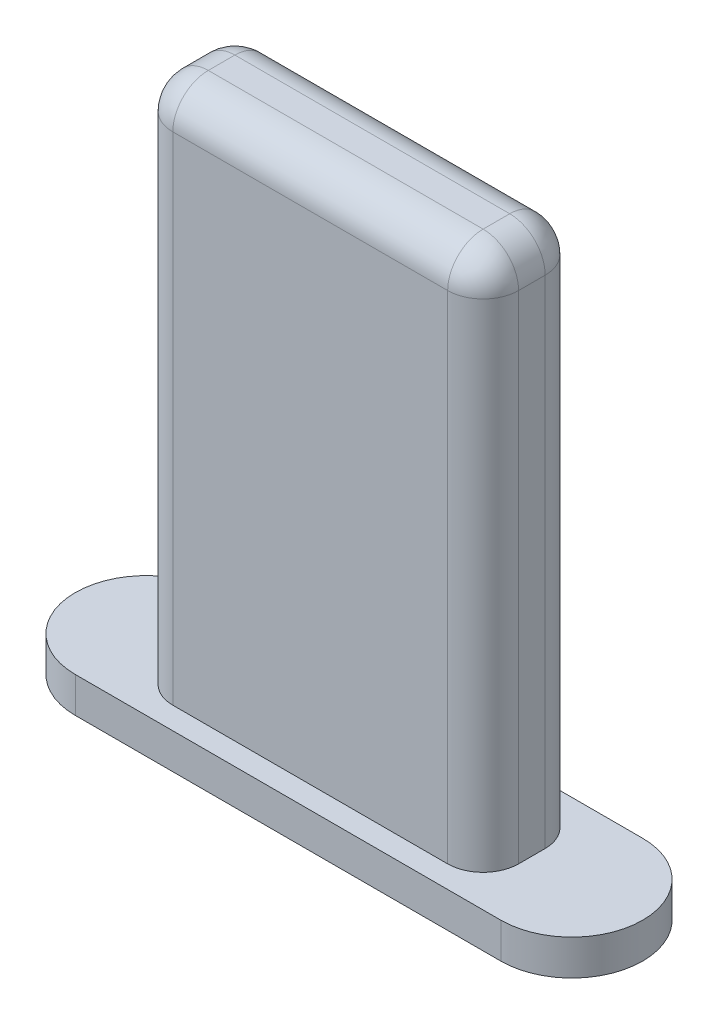
ISO-10303-21;
HEADER;
FILE_DESCRIPTION(('STEP AP214'),'2;1');
FILE_NAME('part.step','',(''),(''),'','','');
FILE_SCHEMA(('AUTOMOTIVE_DESIGN { 1 0 10303 214 1 1 1 1 }'));
ENDSEC;
DATA;
#1=APPLICATION_CONTEXT('core data for automotive mechanical design processes');
#2=APPLICATION_PROTOCOL_DEFINITION('international standard','automotive_design',2000,#1);
#3=PRODUCT_CONTEXT('',#1,'mechanical');
#4=PRODUCT('Part','Part','',(#3));
#5=PRODUCT_RELATED_PRODUCT_CATEGORY('part','',(#4));
#6=PRODUCT_DEFINITION_FORMATION('','',#4);
#7=PRODUCT_DEFINITION_CONTEXT('part definition',#1,'design');
#8=PRODUCT_DEFINITION('design','',#6,#7);
#9=PRODUCT_DEFINITION_SHAPE('','',#8);
#10=(LENGTH_UNIT() NAMED_UNIT(*) SI_UNIT(.MILLI.,.METRE.));
#11=(NAMED_UNIT(*) PLANE_ANGLE_UNIT() SI_UNIT($,.RADIAN.));
#12=(NAMED_UNIT(*) SI_UNIT($,.STERADIAN.) SOLID_ANGLE_UNIT());
#13=UNCERTAINTY_MEASURE_WITH_UNIT(LENGTH_MEASURE(1.E-05),#10,'distance_accuracy_value','');
#14=(GEOMETRIC_REPRESENTATION_CONTEXT(3) GLOBAL_UNCERTAINTY_ASSIGNED_CONTEXT((#13)) GLOBAL_UNIT_ASSIGNED_CONTEXT((#10,
#11,#12)) REPRESENTATION_CONTEXT('',''));
#15=CARTESIAN_POINT('',(0.,0.,0.));
#16=DIRECTION('',(0.,0.,1.));
#17=DIRECTION('',(1.,0.,0.));
#18=AXIS2_PLACEMENT_3D('',#15,#16,#17);
#19=CARTESIAN_POINT('',(6.,1.,0.));
#20=DIRECTION('',(0.,-1.,0.));
#21=DIRECTION('',(0.,0.,-1.));
#22=AXIS2_PLACEMENT_3D('',#19,#20,#21);
#23=CYLINDRICAL_SURFACE('',#22,2.);
#24=CARTESIAN_POINT('',(6.,0.,0.));
#25=DIRECTION('',(0.,1.,0.));
#26=DIRECTION('',(0.,0.,1.));
#27=AXIS2_PLACEMENT_3D('',#24,#25,#26);
#28=CIRCLE('',#27,2.);
#29=CARTESIAN_POINT('',(6.,0.,2.));
#30=VERTEX_POINT('',#29);
#31=CARTESIAN_POINT('',(6.,0.,-2.));
#32=VERTEX_POINT('',#31);
#33=EDGE_CURVE('E162',#30,#32,#28,.T.);
#34=ORIENTED_EDGE('',*,*,#33,.T.);
#35=DIRECTION('',(0.,-1.,0.));
#36=VECTOR('',#35,1.);
#37=CARTESIAN_POINT('',(6.,1.,-2.));
#38=LINE('',#37,#36);
#39=CARTESIAN_POINT('',(6.,1.,-2.));
#40=VERTEX_POINT('',#39);
#41=EDGE_CURVE('E143',#40,#32,#38,.T.);
#42=ORIENTED_EDGE('',*,*,#41,.F.);
#43=CARTESIAN_POINT('',(6.,1.,0.));
#44=DIRECTION('',(0.,1.,0.));
#45=DIRECTION('',(0.,0.,1.));
#46=AXIS2_PLACEMENT_3D('',#43,#44,#45);
#47=CIRCLE('',#46,2.);
#48=CARTESIAN_POINT('',(6.,1.,2.));
#49=VERTEX_POINT('',#48);
#50=EDGE_CURVE('E150',#49,#40,#47,.T.);
#51=ORIENTED_EDGE('',*,*,#50,.F.);
#52=DIRECTION('',(0.,-1.,0.));
#53=VECTOR('',#52,1.);
#54=CARTESIAN_POINT('',(6.,1.,2.));
#55=LINE('',#54,#53);
#56=EDGE_CURVE('E305',#49,#30,#55,.T.);
#57=ORIENTED_EDGE('',*,*,#56,.T.);
#58=EDGE_LOOP('',(#34,#42,#51,#57));
#59=FACE_BOUND('',#58,.T.);
#60=ADVANCED_FACE('F36',(#59),#23,.T.);
#61=CARTESIAN_POINT('',(6.,1.,-2.));
#62=DIRECTION('',(0.,0.,1.));
#63=DIRECTION('',(1.,0.,0.));
#64=AXIS2_PLACEMENT_3D('',#61,#62,#63);
#65=PLANE('',#64);
#66=DIRECTION('',(-1.,0.,0.));
#67=VECTOR('',#66,1.);
#68=CARTESIAN_POINT('',(6.,0.,-2.));
#69=LINE('',#68,#67);
#70=CARTESIAN_POINT('',(-6.,0.,-2.));
#71=VERTEX_POINT('',#70);
#72=EDGE_CURVE('E307',#32,#71,#69,.T.);
#73=ORIENTED_EDGE('',*,*,#72,.T.);
#74=DIRECTION('',(0.,-1.,0.));
#75=VECTOR('',#74,1.);
#76=CARTESIAN_POINT('',(-6.,1.,-2.));
#77=LINE('',#76,#75);
#78=CARTESIAN_POINT('',(-6.,1.,-2.));
#79=VERTEX_POINT('',#78);
#80=EDGE_CURVE('E146',#79,#71,#77,.T.);
#81=ORIENTED_EDGE('',*,*,#80,.F.);
#82=DIRECTION('',(-1.,0.,0.));
#83=VECTOR('',#82,1.);
#84=CARTESIAN_POINT('',(6.,1.,-2.));
#85=LINE('',#84,#83);
#86=EDGE_CURVE('E139',#40,#79,#85,.T.);
#87=ORIENTED_EDGE('',*,*,#86,.F.);
#88=ORIENTED_EDGE('',*,*,#41,.T.);
#89=EDGE_LOOP('',(#73,#81,#87,#88));
#90=FACE_BOUND('',#89,.T.);
#91=ADVANCED_FACE('F141',(#90),#65,.F.);
#92=CARTESIAN_POINT('',(-6.,1.,0.));
#93=DIRECTION('',(0.,-1.,0.));
#94=DIRECTION('',(0.,0.,-1.));
#95=AXIS2_PLACEMENT_3D('',#92,#93,#94);
#96=CYLINDRICAL_SURFACE('',#95,2.);
#97=CARTESIAN_POINT('',(-6.,0.,0.));
#98=DIRECTION('',(0.,1.,0.));
#99=DIRECTION('',(0.,0.,1.));
#100=AXIS2_PLACEMENT_3D('',#97,#98,#99);
#101=CIRCLE('',#100,2.);
#102=CARTESIAN_POINT('',(-6.,0.,2.));
#103=VERTEX_POINT('',#102);
#104=EDGE_CURVE('E309',#71,#103,#101,.T.);
#105=ORIENTED_EDGE('',*,*,#104,.T.);
#106=DIRECTION('',(0.,-1.,0.));
#107=VECTOR('',#106,1.);
#108=CARTESIAN_POINT('',(-6.,1.,2.));
#109=LINE('',#108,#107);
#110=CARTESIAN_POINT('',(-6.,1.,2.));
#111=VERTEX_POINT('',#110);
#112=EDGE_CURVE('E168',#111,#103,#109,.T.);
#113=ORIENTED_EDGE('',*,*,#112,.F.);
#114=CARTESIAN_POINT('',(-6.,1.,0.));
#115=DIRECTION('',(0.,1.,0.));
#116=DIRECTION('',(0.,0.,1.));
#117=AXIS2_PLACEMENT_3D('',#114,#115,#116);
#118=CIRCLE('',#117,2.);
#119=EDGE_CURVE('E149',#79,#111,#118,.T.);
#120=ORIENTED_EDGE('',*,*,#119,.F.);
#121=ORIENTED_EDGE('',*,*,#80,.T.);
#122=EDGE_LOOP('',(#105,#113,#120,#121));
#123=FACE_BOUND('',#122,.T.);
#124=ADVANCED_FACE('F321',(#123),#96,.T.);
#125=CARTESIAN_POINT('',(6.,1.,2.));
#126=DIRECTION('',(0.,0.,-1.));
#127=DIRECTION('',(-1.,0.,0.));
#128=AXIS2_PLACEMENT_3D('',#125,#126,#127);
#129=PLANE('',#128);
#130=DIRECTION('',(1.,0.,0.));
#131=VECTOR('',#130,1.);
#132=CARTESIAN_POINT('',(6.,0.,2.));
#133=LINE('',#132,#131);
#134=EDGE_CURVE('E159',#103,#30,#133,.T.);
#135=ORIENTED_EDGE('',*,*,#134,.T.);
#136=ORIENTED_EDGE('',*,*,#56,.F.);
#137=DIRECTION('',(1.,0.,0.));
#138=VECTOR('',#137,1.);
#139=CARTESIAN_POINT('',(6.,1.,2.));
#140=LINE('',#139,#138);
#141=EDGE_CURVE('E155',#111,#49,#140,.T.);
#142=ORIENTED_EDGE('',*,*,#141,.F.);
#143=ORIENTED_EDGE('',*,*,#112,.T.);
#144=EDGE_LOOP('',(#135,#136,#142,#143));
#145=FACE_BOUND('',#144,.T.);
#146=ADVANCED_FACE('F316',(#145),#129,.F.);
#147=CARTESIAN_POINT('',(6.,1.,0.));
#148=DIRECTION('',(0.,1.,0.));
#149=DIRECTION('',(0.,0.,1.));
#150=AXIS2_PLACEMENT_3D('',#147,#148,#149);
#151=PLANE('',#150);
#152=DIRECTION('',(0.,0.,1.));
#153=VECTOR('',#152,1.);
#154=CARTESIAN_POINT('',(-4.875,1.,1.375));
#155=LINE('',#154,#153);
#156=CARTESIAN_POINT('',(-4.875,1.,-0.374999999999999));
#157=VERTEX_POINT('',#156);
#158=CARTESIAN_POINT('',(-4.875,1.,0.375000000000001));
#159=VERTEX_POINT('',#158);
#160=EDGE_CURVE('E233',#157,#159,#155,.T.);
#161=ORIENTED_EDGE('',*,*,#160,.F.);
#162=CARTESIAN_POINT('',(-3.875,1.,-0.374999999999999));
#163=DIRECTION('',(0.,1.,0.));
#164=DIRECTION('',(0.,0.,1.));
#165=AXIS2_PLACEMENT_3D('',#162,#163,#164);
#166=CIRCLE('',#165,1.);
#167=CARTESIAN_POINT('',(-3.875,1.,-1.375));
#168=VERTEX_POINT('',#167);
#169=EDGE_CURVE('E228',#157,#168,#166,.F.);
#170=ORIENTED_EDGE('',*,*,#169,.T.);
#171=DIRECTION('',(-1.,0.,0.));
#172=VECTOR('',#171,1.);
#173=CARTESIAN_POINT('',(4.875,1.,-1.375));
#174=LINE('',#173,#172);
#175=CARTESIAN_POINT('',(3.875,1.,-1.375));
#176=VERTEX_POINT('',#175);
#177=EDGE_CURVE('E300',#176,#168,#174,.T.);
#178=ORIENTED_EDGE('',*,*,#177,.F.);
#179=CARTESIAN_POINT('',(3.875,1.,-0.375));
#180=DIRECTION('',(0.,1.,0.));
#181=DIRECTION('',(0.,0.,1.));
#182=AXIS2_PLACEMENT_3D('',#179,#180,#181);
#183=CIRCLE('',#182,1.);
#184=CARTESIAN_POINT('',(4.875,1.,-0.375));
#185=VERTEX_POINT('',#184);
#186=EDGE_CURVE('E226',#176,#185,#183,.F.);
#187=ORIENTED_EDGE('',*,*,#186,.T.);
#188=DIRECTION('',(0.,0.,-1.));
#189=VECTOR('',#188,1.);
#190=CARTESIAN_POINT('',(4.875,1.,1.375));
#191=LINE('',#190,#189);
#192=CARTESIAN_POINT('',(4.875,1.,0.375));
#193=VERTEX_POINT('',#192);
#194=EDGE_CURVE('E258',#193,#185,#191,.T.);
#195=ORIENTED_EDGE('',*,*,#194,.F.);
#196=CARTESIAN_POINT('',(3.875,1.,0.375));
#197=DIRECTION('',(0.,1.,0.));
#198=DIRECTION('',(0.,0.,1.));
#199=AXIS2_PLACEMENT_3D('',#196,#197,#198);
#200=CIRCLE('',#199,1.);
#201=CARTESIAN_POINT('',(3.875,1.,1.375));
#202=VERTEX_POINT('',#201);
#203=EDGE_CURVE('E11',#193,#202,#200,.F.);
#204=ORIENTED_EDGE('',*,*,#203,.T.);
#205=DIRECTION('',(1.,0.,0.));
#206=VECTOR('',#205,1.);
#207=CARTESIAN_POINT('',(4.875,1.,1.375));
#208=LINE('',#207,#206);
#209=CARTESIAN_POINT('',(-3.875,1.,1.375));
#210=VERTEX_POINT('',#209);
#211=EDGE_CURVE('E292',#210,#202,#208,.T.);
#212=ORIENTED_EDGE('',*,*,#211,.F.);
#213=CARTESIAN_POINT('',(-3.875,1.,0.375000000000001));
#214=DIRECTION('',(0.,1.,0.));
#215=DIRECTION('',(0.,0.,1.));
#216=AXIS2_PLACEMENT_3D('',#213,#214,#215);
#217=CIRCLE('',#216,1.);
#218=EDGE_CURVE('E45',#210,#159,#217,.F.);
#219=ORIENTED_EDGE('',*,*,#218,.T.);
#220=EDGE_LOOP('',(#161,#170,#178,#187,#195,#204,#212,#219));
#221=FACE_BOUND('',#220,.T.);
#222=ORIENTED_EDGE('',*,*,#50,.T.);
#223=ORIENTED_EDGE('',*,*,#86,.T.);
#224=ORIENTED_EDGE('',*,*,#119,.T.);
#225=ORIENTED_EDGE('',*,*,#141,.T.);
#226=EDGE_LOOP('',(#222,#223,#224,#225));
#227=FACE_BOUND('',#226,.T.);
#228=ADVANCED_FACE('F153',(#221,#227),#151,.T.);
#229=CARTESIAN_POINT('',(6.,0.,0.));
#230=DIRECTION('',(0.,1.,0.));
#231=DIRECTION('',(0.,0.,1.));
#232=AXIS2_PLACEMENT_3D('',#229,#230,#231);
#233=PLANE('',#232);
#234=ORIENTED_EDGE('',*,*,#33,.F.);
#235=ORIENTED_EDGE('',*,*,#134,.F.);
#236=ORIENTED_EDGE('',*,*,#104,.F.);
#237=ORIENTED_EDGE('',*,*,#72,.F.);
#238=EDGE_LOOP('',(#234,#235,#236,#237));
#239=FACE_BOUND('',#238,.T.);
#240=ADVANCED_FACE('F320',(#239),#233,.F.);
#241=CARTESIAN_POINT('',(-4.875,16.,1.375));
#242=DIRECTION('',(1.,0.,0.));
#243=DIRECTION('',(0.,0.,-1.));
#244=AXIS2_PLACEMENT_3D('',#241,#242,#243);
#245=PLANE('',#244);
#246=DIRECTION('',(0.,0.,1.));
#247=VECTOR('',#246,1.);
#248=CARTESIAN_POINT('',(-4.875,15.,-1.375));
#249=LINE('',#248,#247);
#250=CARTESIAN_POINT('',(-4.875,15.,0.375000000000001));
#251=VERTEX_POINT('',#250);
#252=CARTESIAN_POINT('',(-4.875,15.,-0.374999999999999));
#253=VERTEX_POINT('',#252);
#254=EDGE_CURVE('E188',#251,#253,#249,.F.);
#255=ORIENTED_EDGE('',*,*,#254,.T.);
#256=DIRECTION('',(0.,-1.,0.));
#257=VECTOR('',#256,1.);
#258=CARTESIAN_POINT('',(-4.875,16.,-0.374999999999999));
#259=LINE('',#258,#257);
#260=EDGE_CURVE('E221',#253,#157,#259,.T.);
#261=ORIENTED_EDGE('',*,*,#260,.T.);
#262=ORIENTED_EDGE('',*,*,#160,.T.);
#263=DIRECTION('',(0.,-1.,0.));
#264=VECTOR('',#263,1.);
#265=CARTESIAN_POINT('',(-4.875,16.,0.375000000000001));
#266=LINE('',#265,#264);
#267=EDGE_CURVE('E219',#159,#251,#266,.F.);
#268=ORIENTED_EDGE('',*,*,#267,.T.);
#269=EDGE_LOOP('',(#255,#261,#262,#268));
#270=FACE_BOUND('',#269,.T.);
#271=ADVANCED_FACE('F294',(#270),#245,.F.);
#272=CARTESIAN_POINT('',(4.875,16.,1.375));
#273=DIRECTION('',(0.,0.,-1.));
#274=DIRECTION('',(-1.,0.,0.));
#275=AXIS2_PLACEMENT_3D('',#272,#273,#274);
#276=PLANE('',#275);
#277=DIRECTION('',(1.,0.,0.));
#278=VECTOR('',#277,1.);
#279=CARTESIAN_POINT('',(-4.875,15.,1.375));
#280=LINE('',#279,#278);
#281=CARTESIAN_POINT('',(3.875,15.,1.375));
#282=VERTEX_POINT('',#281);
#283=CARTESIAN_POINT('',(-3.875,15.,1.375));
#284=VERTEX_POINT('',#283);
#285=EDGE_CURVE('E186',#282,#284,#280,.F.);
#286=ORIENTED_EDGE('',*,*,#285,.T.);
#287=DIRECTION('',(0.,-1.,0.));
#288=VECTOR('',#287,1.);
#289=CARTESIAN_POINT('',(-3.875,16.,1.375));
#290=LINE('',#289,#288);
#291=EDGE_CURVE('E58',#284,#210,#290,.T.);
#292=ORIENTED_EDGE('',*,*,#291,.T.);
#293=ORIENTED_EDGE('',*,*,#211,.T.);
#294=DIRECTION('',(0.,-1.,0.));
#295=VECTOR('',#294,1.);
#296=CARTESIAN_POINT('',(3.875,16.,1.375));
#297=LINE('',#296,#295);
#298=EDGE_CURVE('E223',#202,#282,#297,.F.);
#299=ORIENTED_EDGE('',*,*,#298,.T.);
#300=EDGE_LOOP('',(#286,#292,#293,#299));
#301=FACE_BOUND('',#300,.T.);
#302=ADVANCED_FACE('F284',(#301),#276,.F.);
#303=CARTESIAN_POINT('',(4.875,16.,1.375));
#304=DIRECTION('',(-1.,0.,0.));
#305=DIRECTION('',(0.,0.,1.));
#306=AXIS2_PLACEMENT_3D('',#303,#304,#305);
#307=PLANE('',#306);
#308=ORIENTED_EDGE('',*,*,#194,.T.);
#309=DIRECTION('',(0.,-1.,0.));
#310=VECTOR('',#309,1.);
#311=CARTESIAN_POINT('',(4.875,16.,-0.375));
#312=LINE('',#311,#310);
#313=CARTESIAN_POINT('',(4.875,15.,-0.375));
#314=VERTEX_POINT('',#313);
#315=EDGE_CURVE('E217',#185,#314,#312,.F.);
#316=ORIENTED_EDGE('',*,*,#315,.T.);
#317=DIRECTION('',(0.,0.,-1.));
#318=VECTOR('',#317,1.);
#319=CARTESIAN_POINT('',(4.875,15.,1.375));
#320=LINE('',#319,#318);
#321=CARTESIAN_POINT('',(4.875,15.,0.375));
#322=VERTEX_POINT('',#321);
#323=EDGE_CURVE('E183',#314,#322,#320,.F.);
#324=ORIENTED_EDGE('',*,*,#323,.T.);
#325=DIRECTION('',(0.,-1.,0.));
#326=VECTOR('',#325,1.);
#327=CARTESIAN_POINT('',(4.875,16.,0.375));
#328=LINE('',#327,#326);
#329=EDGE_CURVE('E215',#322,#193,#328,.T.);
#330=ORIENTED_EDGE('',*,*,#329,.T.);
#331=EDGE_LOOP('',(#308,#316,#324,#330));
#332=FACE_BOUND('',#331,.T.);
#333=ADVANCED_FACE('F256',(#332),#307,.F.);
#334=CARTESIAN_POINT('',(4.875,16.,-1.375));
#335=DIRECTION('',(0.,0.,1.));
#336=DIRECTION('',(1.,0.,0.));
#337=AXIS2_PLACEMENT_3D('',#334,#335,#336);
#338=PLANE('',#337);
#339=DIRECTION('',(-1.,0.,0.));
#340=VECTOR('',#339,1.);
#341=CARTESIAN_POINT('',(4.875,15.,-1.375));
#342=LINE('',#341,#340);
#343=CARTESIAN_POINT('',(-3.875,15.,-1.375));
#344=VERTEX_POINT('',#343);
#345=CARTESIAN_POINT('',(3.875,15.,-1.375));
#346=VERTEX_POINT('',#345);
#347=EDGE_CURVE('E180',#344,#346,#342,.F.);
#348=ORIENTED_EDGE('',*,*,#347,.T.);
#349=DIRECTION('',(0.,-1.,0.));
#350=VECTOR('',#349,1.);
#351=CARTESIAN_POINT('',(3.875,16.,-1.375));
#352=LINE('',#351,#350);
#353=EDGE_CURVE('E213',#346,#176,#352,.T.);
#354=ORIENTED_EDGE('',*,*,#353,.T.);
#355=ORIENTED_EDGE('',*,*,#177,.T.);
#356=DIRECTION('',(0.,-1.,0.));
#357=VECTOR('',#356,1.);
#358=CARTESIAN_POINT('',(-3.875,16.,-1.375));
#359=LINE('',#358,#357);
#360=EDGE_CURVE('E211',#168,#344,#359,.F.);
#361=ORIENTED_EDGE('',*,*,#360,.T.);
#362=EDGE_LOOP('',(#348,#354,#355,#361));
#363=FACE_BOUND('',#362,.T.);
#364=ADVANCED_FACE('F419',(#363),#338,.F.);
#365=CARTESIAN_POINT('',(0.,16.,0.));
#366=DIRECTION('',(0.,1.,0.));
#367=DIRECTION('',(0.,0.,1.));
#368=AXIS2_PLACEMENT_3D('',#365,#366,#367);
#369=PLANE('',#368);
#370=DIRECTION('',(0.,0.,-1.));
#371=VECTOR('',#370,1.);
#372=CARTESIAN_POINT('',(3.875,16.,-1.375));
#373=LINE('',#372,#371);
#374=CARTESIAN_POINT('',(3.875,16.,0.375));
#375=VERTEX_POINT('',#374);
#376=CARTESIAN_POINT('',(3.875,16.,-0.375));
#377=VERTEX_POINT('',#376);
#378=EDGE_CURVE('E174',#375,#377,#373,.T.);
#379=ORIENTED_EDGE('',*,*,#378,.T.);
#380=DIRECTION('',(-1.,0.,0.));
#381=VECTOR('',#380,1.);
#382=CARTESIAN_POINT('',(-4.875,16.,-0.374999999999999));
#383=LINE('',#382,#381);
#384=CARTESIAN_POINT('',(-3.875,16.,-0.374999999999999));
#385=VERTEX_POINT('',#384);
#386=EDGE_CURVE('E177',#377,#385,#383,.T.);
#387=ORIENTED_EDGE('',*,*,#386,.T.);
#388=DIRECTION('',(0.,0.,1.));
#389=VECTOR('',#388,1.);
#390=CARTESIAN_POINT('',(-3.875,16.,1.375));
#391=LINE('',#390,#389);
#392=CARTESIAN_POINT('',(-3.875,16.,0.375000000000001));
#393=VERTEX_POINT('',#392);
#394=EDGE_CURVE('E163',#385,#393,#391,.T.);
#395=ORIENTED_EDGE('',*,*,#394,.T.);
#396=DIRECTION('',(1.,0.,0.));
#397=VECTOR('',#396,1.);
#398=CARTESIAN_POINT('',(4.875,16.,0.374999999999999));
#399=LINE('',#398,#397);
#400=EDGE_CURVE('E166',#393,#375,#399,.T.);
#401=ORIENTED_EDGE('',*,*,#400,.T.);
#402=EDGE_LOOP('',(#379,#387,#395,#401));
#403=FACE_BOUND('',#402,.T.);
#404=ADVANCED_FACE('F269',(#403),#369,.T.);
#405=CARTESIAN_POINT('',(0.,15.,0.375));
#406=DIRECTION('',(-1.,0.,0.));
#407=DIRECTION('',(0.,0.,1.));
#408=AXIS2_PLACEMENT_3D('',#405,#406,#407);
#409=CYLINDRICAL_SURFACE('',#408,1.);
#410=ORIENTED_EDGE('',*,*,#400,.F.);
#411=CARTESIAN_POINT('',(-3.875,15.,0.375000000000001));
#412=DIRECTION('',(-1.,0.,0.));
#413=DIRECTION('',(0.,0.,1.));
#414=AXIS2_PLACEMENT_3D('',#411,#412,#413);
#415=CIRCLE('',#414,1.);
#416=EDGE_CURVE('E209',#393,#284,#415,.F.);
#417=ORIENTED_EDGE('',*,*,#416,.T.);
#418=ORIENTED_EDGE('',*,*,#285,.F.);
#419=CARTESIAN_POINT('',(3.875,15.,0.375));
#420=DIRECTION('',(-1.,0.,0.));
#421=DIRECTION('',(0.,0.,1.));
#422=AXIS2_PLACEMENT_3D('',#419,#420,#421);
#423=CIRCLE('',#422,1.);
#424=EDGE_CURVE('E207',#282,#375,#423,.T.);
#425=ORIENTED_EDGE('',*,*,#424,.T.);
#426=EDGE_LOOP('',(#410,#417,#418,#425));
#427=FACE_BOUND('',#426,.T.);
#428=ADVANCED_FACE('F282',(#427),#409,.T.);
#429=CARTESIAN_POINT('',(3.875,15.,0.));
#430=DIRECTION('',(0.,0.,1.));
#431=DIRECTION('',(1.,0.,0.));
#432=AXIS2_PLACEMENT_3D('',#429,#430,#431);
#433=CYLINDRICAL_SURFACE('',#432,1.);
#434=ORIENTED_EDGE('',*,*,#323,.F.);
#435=CARTESIAN_POINT('',(3.875,15.,-0.375));
#436=DIRECTION('',(0.,0.,1.));
#437=DIRECTION('',(1.,0.,0.));
#438=AXIS2_PLACEMENT_3D('',#435,#436,#437);
#439=CIRCLE('',#438,1.);
#440=EDGE_CURVE('E200',#314,#377,#439,.T.);
#441=ORIENTED_EDGE('',*,*,#440,.T.);
#442=ORIENTED_EDGE('',*,*,#378,.F.);
#443=CARTESIAN_POINT('',(3.875,15.,0.375));
#444=DIRECTION('',(0.,0.,1.));
#445=DIRECTION('',(1.,0.,0.));
#446=AXIS2_PLACEMENT_3D('',#443,#444,#445);
#447=CIRCLE('',#446,1.);
#448=EDGE_CURVE('E197',#375,#322,#447,.F.);
#449=ORIENTED_EDGE('',*,*,#448,.T.);
#450=EDGE_LOOP('',(#434,#441,#442,#449));
#451=FACE_BOUND('',#450,.T.);
#452=ADVANCED_FACE('F254',(#451),#433,.T.);
#453=CARTESIAN_POINT('',(-3.875,15.,0.));
#454=DIRECTION('',(0.,0.,-1.));
#455=DIRECTION('',(-1.,0.,0.));
#456=AXIS2_PLACEMENT_3D('',#453,#454,#455);
#457=CYLINDRICAL_SURFACE('',#456,1.);
#458=ORIENTED_EDGE('',*,*,#394,.F.);
#459=CARTESIAN_POINT('',(-3.875,15.,-0.374999999999999));
#460=DIRECTION('',(0.,0.,-1.));
#461=DIRECTION('',(-1.,0.,0.));
#462=AXIS2_PLACEMENT_3D('',#459,#460,#461);
#463=CIRCLE('',#462,1.);
#464=EDGE_CURVE('E205',#385,#253,#463,.F.);
#465=ORIENTED_EDGE('',*,*,#464,.T.);
#466=ORIENTED_EDGE('',*,*,#254,.F.);
#467=CARTESIAN_POINT('',(-3.875,15.,0.375000000000001));
#468=DIRECTION('',(0.,0.,-1.));
#469=DIRECTION('',(-1.,0.,0.));
#470=AXIS2_PLACEMENT_3D('',#467,#468,#469);
#471=CIRCLE('',#470,1.);
#472=EDGE_CURVE('E202',#251,#393,#471,.T.);
#473=ORIENTED_EDGE('',*,*,#472,.T.);
#474=EDGE_LOOP('',(#458,#465,#466,#473));
#475=FACE_BOUND('',#474,.T.);
#476=ADVANCED_FACE('F279',(#475),#457,.T.);
#477=CARTESIAN_POINT('',(0.,15.,-0.375));
#478=DIRECTION('',(1.,0.,0.));
#479=DIRECTION('',(0.,0.,-1.));
#480=AXIS2_PLACEMENT_3D('',#477,#478,#479);
#481=CYLINDRICAL_SURFACE('',#480,1.);
#482=ORIENTED_EDGE('',*,*,#386,.F.);
#483=CARTESIAN_POINT('',(3.875,15.,-0.375));
#484=DIRECTION('',(1.,0.,0.));
#485=DIRECTION('',(0.,0.,-1.));
#486=AXIS2_PLACEMENT_3D('',#483,#484,#485);
#487=CIRCLE('',#486,1.);
#488=EDGE_CURVE('E194',#377,#346,#487,.F.);
#489=ORIENTED_EDGE('',*,*,#488,.T.);
#490=ORIENTED_EDGE('',*,*,#347,.F.);
#491=CARTESIAN_POINT('',(-3.875,15.,-0.374999999999999));
#492=DIRECTION('',(1.,0.,0.));
#493=DIRECTION('',(0.,0.,-1.));
#494=AXIS2_PLACEMENT_3D('',#491,#492,#493);
#495=CIRCLE('',#494,1.);
#496=EDGE_CURVE('E191',#344,#385,#495,.T.);
#497=ORIENTED_EDGE('',*,*,#496,.T.);
#498=EDGE_LOOP('',(#482,#489,#490,#497));
#499=FACE_BOUND('',#498,.T.);
#500=ADVANCED_FACE('F272',(#499),#481,.T.);
#501=CARTESIAN_POINT('',(3.875,16.,-0.375));
#502=DIRECTION('',(0.,-1.,0.));
#503=DIRECTION('',(0.,0.,-1.));
#504=AXIS2_PLACEMENT_3D('',#501,#502,#503);
#505=CYLINDRICAL_SURFACE('',#504,1.);
#506=ORIENTED_EDGE('',*,*,#186,.F.);
#507=ORIENTED_EDGE('',*,*,#353,.F.);
#508=CARTESIAN_POINT('',(3.875,15.,-0.375));
#509=DIRECTION('',(0.,1.,0.));
#510=DIRECTION('',(0.,0.,1.));
#511=AXIS2_PLACEMENT_3D('',#508,#509,#510);
#512=CIRCLE('',#511,1.);
#513=EDGE_CURVE('E231',#314,#346,#512,.T.);
#514=ORIENTED_EDGE('',*,*,#513,.F.);
#515=ORIENTED_EDGE('',*,*,#315,.F.);
#516=EDGE_LOOP('',(#506,#507,#514,#515));
#517=FACE_BOUND('',#516,.T.);
#518=ADVANCED_FACE('F262',(#517),#505,.T.);
#519=CARTESIAN_POINT('',(3.875,15.,-0.375));
#520=DIRECTION('',(0.,0.,1.));
#521=DIRECTION('',(1.,0.,0.));
#522=AXIS2_PLACEMENT_3D('',#519,#520,#521);
#523=SPHERICAL_SURFACE('',#522,1.);
#524=ORIENTED_EDGE('',*,*,#488,.F.);
#525=ORIENTED_EDGE('',*,*,#440,.F.);
#526=ORIENTED_EDGE('',*,*,#513,.T.);
#527=EDGE_LOOP('',(#524,#525,#526));
#528=FACE_BOUND('',#527,.T.);
#529=ADVANCED_FACE('F266',(#528),#523,.T.);
#530=CARTESIAN_POINT('',(-3.875,16.,-0.374999999999999));
#531=DIRECTION('',(0.,-1.,0.));
#532=DIRECTION('',(0.,0.,-1.));
#533=AXIS2_PLACEMENT_3D('',#530,#531,#532);
#534=CYLINDRICAL_SURFACE('',#533,1.);
#535=ORIENTED_EDGE('',*,*,#169,.F.);
#536=ORIENTED_EDGE('',*,*,#260,.F.);
#537=CARTESIAN_POINT('',(-3.875,15.,-0.374999999999999));
#538=DIRECTION('',(0.,1.,0.));
#539=DIRECTION('',(0.,0.,1.));
#540=AXIS2_PLACEMENT_3D('',#537,#538,#539);
#541=CIRCLE('',#540,1.);
#542=EDGE_CURVE('E234',#344,#253,#541,.T.);
#543=ORIENTED_EDGE('',*,*,#542,.F.);
#544=ORIENTED_EDGE('',*,*,#360,.F.);
#545=EDGE_LOOP('',(#535,#536,#543,#544));
#546=FACE_BOUND('',#545,.T.);
#547=ADVANCED_FACE('F345',(#546),#534,.T.);
#548=CARTESIAN_POINT('',(-3.875,15.,-0.374999999999999));
#549=DIRECTION('',(0.,0.,1.));
#550=DIRECTION('',(1.,0.,0.));
#551=AXIS2_PLACEMENT_3D('',#548,#549,#550);
#552=SPHERICAL_SURFACE('',#551,1.);
#553=ORIENTED_EDGE('',*,*,#542,.T.);
#554=ORIENTED_EDGE('',*,*,#464,.F.);
#555=ORIENTED_EDGE('',*,*,#496,.F.);
#556=EDGE_LOOP('',(#553,#554,#555));
#557=FACE_BOUND('',#556,.T.);
#558=ADVANCED_FACE('F348',(#557),#552,.T.);
#559=CARTESIAN_POINT('',(-3.875,16.,0.375000000000001));
#560=DIRECTION('',(0.,-1.,0.));
#561=DIRECTION('',(0.,0.,-1.));
#562=AXIS2_PLACEMENT_3D('',#559,#560,#561);
#563=CYLINDRICAL_SURFACE('',#562,1.);
#564=ORIENTED_EDGE('',*,*,#218,.F.);
#565=ORIENTED_EDGE('',*,*,#291,.F.);
#566=CARTESIAN_POINT('',(-3.875,15.,0.375000000000001));
#567=DIRECTION('',(0.,1.,0.));
#568=DIRECTION('',(0.,0.,1.));
#569=AXIS2_PLACEMENT_3D('',#566,#567,#568);
#570=CIRCLE('',#569,1.);
#571=EDGE_CURVE('E236',#251,#284,#570,.T.);
#572=ORIENTED_EDGE('',*,*,#571,.F.);
#573=ORIENTED_EDGE('',*,*,#267,.F.);
#574=EDGE_LOOP('',(#564,#565,#572,#573));
#575=FACE_BOUND('',#574,.T.);
#576=ADVANCED_FACE('F287',(#575),#563,.T.);
#577=CARTESIAN_POINT('',(-3.875,15.,0.375000000000001));
#578=DIRECTION('',(0.,0.,1.));
#579=DIRECTION('',(1.,0.,0.));
#580=AXIS2_PLACEMENT_3D('',#577,#578,#579);
#581=SPHERICAL_SURFACE('',#580,1.);
#582=ORIENTED_EDGE('',*,*,#571,.T.);
#583=ORIENTED_EDGE('',*,*,#416,.F.);
#584=ORIENTED_EDGE('',*,*,#472,.F.);
#585=EDGE_LOOP('',(#582,#583,#584));
#586=FACE_BOUND('',#585,.T.);
#587=ADVANCED_FACE('F354',(#586),#581,.T.);
#588=CARTESIAN_POINT('',(3.875,16.,0.375));
#589=DIRECTION('',(0.,-1.,0.));
#590=DIRECTION('',(0.,0.,-1.));
#591=AXIS2_PLACEMENT_3D('',#588,#589,#590);
#592=CYLINDRICAL_SURFACE('',#591,1.);
#593=ORIENTED_EDGE('',*,*,#203,.F.);
#594=ORIENTED_EDGE('',*,*,#329,.F.);
#595=CARTESIAN_POINT('',(3.875,15.,0.375));
#596=DIRECTION('',(0.,1.,0.));
#597=DIRECTION('',(0.,0.,1.));
#598=AXIS2_PLACEMENT_3D('',#595,#596,#597);
#599=CIRCLE('',#598,1.);
#600=EDGE_CURVE('E40',#282,#322,#599,.T.);
#601=ORIENTED_EDGE('',*,*,#600,.F.);
#602=ORIENTED_EDGE('',*,*,#298,.F.);
#603=EDGE_LOOP('',(#593,#594,#601,#602));
#604=FACE_BOUND('',#603,.T.);
#605=ADVANCED_FACE('F38',(#604),#592,.T.);
#606=CARTESIAN_POINT('',(3.875,15.,0.375));
#607=DIRECTION('',(0.,0.,1.));
#608=DIRECTION('',(1.,0.,0.));
#609=AXIS2_PLACEMENT_3D('',#606,#607,#608);
#610=SPHERICAL_SURFACE('',#609,1.);
#611=ORIENTED_EDGE('',*,*,#448,.F.);
#612=ORIENTED_EDGE('',*,*,#424,.F.);
#613=ORIENTED_EDGE('',*,*,#600,.T.);
#614=EDGE_LOOP('',(#611,#612,#613));
#615=FACE_BOUND('',#614,.T.);
#616=ADVANCED_FACE('F246',(#615),#610,.T.);
#617=CLOSED_SHELL('',(#60,#91,#124,#146,#228,#240,#271,#302,#333,#364,#404,#428,#452,#476,#500,
#518,#529,#547,#558,#576,#587,#605,#616));
#618=MANIFOLD_SOLID_BREP('B2',#617);
#619=ADVANCED_BREP_SHAPE_REPRESENTATION('',(#18,#618),#14);
#620=SHAPE_DEFINITION_REPRESENTATION(#9,#619);
ENDSEC;
END-ISO-10303-21;
